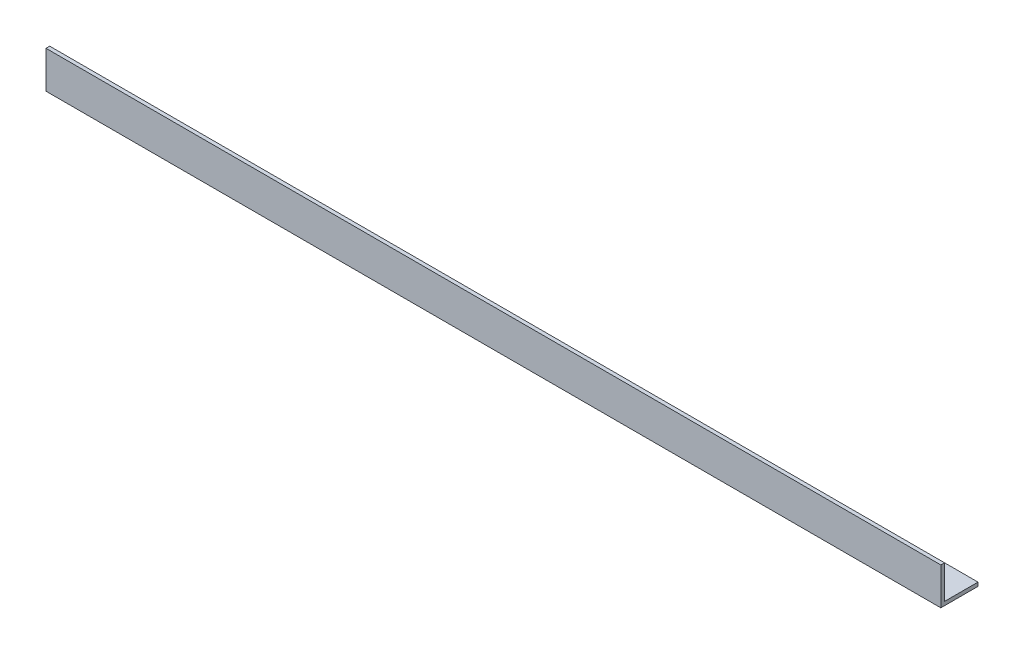
ISO-10303-21;
HEADER;
FILE_DESCRIPTION(('STEP AP214'),'2;1');
FILE_NAME('part.step','',(''),(''),'','','');
FILE_SCHEMA(('AUTOMOTIVE_DESIGN { 1 0 10303 214 1 1 1 1 }'));
ENDSEC;
DATA;
#1=APPLICATION_CONTEXT('core data for automotive mechanical design processes');
#2=APPLICATION_PROTOCOL_DEFINITION('international standard','automotive_design',2000,#1);
#3=PRODUCT_CONTEXT('',#1,'mechanical');
#4=PRODUCT('Part','Part','',(#3));
#5=PRODUCT_RELATED_PRODUCT_CATEGORY('part','',(#4));
#6=PRODUCT_DEFINITION_FORMATION('','',#4);
#7=PRODUCT_DEFINITION_CONTEXT('part definition',#1,'design');
#8=PRODUCT_DEFINITION('design','',#6,#7);
#9=PRODUCT_DEFINITION_SHAPE('','',#8);
#10=(LENGTH_UNIT() NAMED_UNIT(*) SI_UNIT(.MILLI.,.METRE.));
#11=(NAMED_UNIT(*) PLANE_ANGLE_UNIT() SI_UNIT($,.RADIAN.));
#12=(NAMED_UNIT(*) SI_UNIT($,.STERADIAN.) SOLID_ANGLE_UNIT());
#13=UNCERTAINTY_MEASURE_WITH_UNIT(LENGTH_MEASURE(1.E-05),#10,'distance_accuracy_value','');
#14=(GEOMETRIC_REPRESENTATION_CONTEXT(3) GLOBAL_UNCERTAINTY_ASSIGNED_CONTEXT((#13)) GLOBAL_UNIT_ASSIGNED_CONTEXT((#10,
#11,#12)) REPRESENTATION_CONTEXT('',''));
#15=CARTESIAN_POINT('',(0.,0.,0.));
#16=DIRECTION('',(0.,0.,1.));
#17=DIRECTION('',(1.,0.,0.));
#18=AXIS2_PLACEMENT_3D('',#15,#16,#17);
#19=CARTESIAN_POINT('',(361.,0.,-15.));
#20=DIRECTION('',(0.,1.,0.));
#21=DIRECTION('',(0.,0.,1.));
#22=AXIS2_PLACEMENT_3D('',#19,#20,#21);
#23=PLANE('',#22);
#24=DIRECTION('',(0.,0.,-1.));
#25=VECTOR('',#24,1.);
#26=CARTESIAN_POINT('',(0.,0.,-15.));
#27=LINE('',#26,#25);
#28=CARTESIAN_POINT('',(0.,0.,0.));
#29=VERTEX_POINT('',#28);
#30=CARTESIAN_POINT('',(0.,0.,-15.));
#31=VERTEX_POINT('',#30);
#32=EDGE_CURVE('E119',#29,#31,#27,.T.);
#33=ORIENTED_EDGE('',*,*,#32,.T.);
#34=DIRECTION('',(-1.,0.,0.));
#35=VECTOR('',#34,1.);
#36=CARTESIAN_POINT('',(361.,0.,-15.));
#37=LINE('',#36,#35);
#38=CARTESIAN_POINT('',(361.,0.,-15.));
#39=VERTEX_POINT('',#38);
#40=EDGE_CURVE('E11',#39,#31,#37,.T.);
#41=ORIENTED_EDGE('',*,*,#40,.F.);
#42=DIRECTION('',(0.,0.,-1.));
#43=VECTOR('',#42,1.);
#44=CARTESIAN_POINT('',(361.,0.,-15.));
#45=LINE('',#44,#43);
#46=CARTESIAN_POINT('',(361.,0.,0.));
#47=VERTEX_POINT('',#46);
#48=EDGE_CURVE('E129',#47,#39,#45,.T.);
#49=ORIENTED_EDGE('',*,*,#48,.F.);
#50=DIRECTION('',(-1.,0.,0.));
#51=VECTOR('',#50,1.);
#52=CARTESIAN_POINT('',(361.,0.,0.));
#53=LINE('',#52,#51);
#54=EDGE_CURVE('E115',#47,#29,#53,.T.);
#55=ORIENTED_EDGE('',*,*,#54,.T.);
#56=EDGE_LOOP('',(#33,#41,#49,#55));
#57=FACE_BOUND('',#56,.T.);
#58=ADVANCED_FACE('F35',(#57),#23,.F.);
#59=CARTESIAN_POINT('',(361.,1.49999999999998,-15.));
#60=DIRECTION('',(0.,0.,1.));
#61=DIRECTION('',(1.,0.,0.));
#62=AXIS2_PLACEMENT_3D('',#59,#60,#61);
#63=PLANE('',#62);
#64=DIRECTION('',(0.,1.,0.));
#65=VECTOR('',#64,1.);
#66=CARTESIAN_POINT('',(0.,1.49999999999998,-15.));
#67=LINE('',#66,#65);
#68=CARTESIAN_POINT('',(0.,1.49999999999998,-15.));
#69=VERTEX_POINT('',#68);
#70=EDGE_CURVE('E122',#31,#69,#67,.T.);
#71=ORIENTED_EDGE('',*,*,#70,.T.);
#72=DIRECTION('',(-1.,0.,0.));
#73=VECTOR('',#72,1.);
#74=CARTESIAN_POINT('',(361.,1.49999999999998,-15.));
#75=LINE('',#74,#73);
#76=CARTESIAN_POINT('',(361.,1.49999999999998,-15.));
#77=VERTEX_POINT('',#76);
#78=EDGE_CURVE('E43',#77,#69,#75,.T.);
#79=ORIENTED_EDGE('',*,*,#78,.F.);
#80=DIRECTION('',(0.,1.,0.));
#81=VECTOR('',#80,1.);
#82=CARTESIAN_POINT('',(361.,1.49999999999998,-15.));
#83=LINE('',#82,#81);
#84=EDGE_CURVE('E88',#39,#77,#83,.T.);
#85=ORIENTED_EDGE('',*,*,#84,.F.);
#86=ORIENTED_EDGE('',*,*,#40,.T.);
#87=EDGE_LOOP('',(#71,#79,#85,#86));
#88=FACE_BOUND('',#87,.T.);
#89=ADVANCED_FACE('F153',(#88),#63,.F.);
#90=CARTESIAN_POINT('',(361.,1.5,-1.50000000000002));
#91=DIRECTION('',(0.,-1.,0.));
#92=DIRECTION('',(0.,0.,-1.));
#93=AXIS2_PLACEMENT_3D('',#90,#91,#92);
#94=PLANE('',#93);
#95=DIRECTION('',(0.,0.,1.));
#96=VECTOR('',#95,1.);
#97=CARTESIAN_POINT('',(0.,1.5,-1.50000000000002));
#98=LINE('',#97,#96);
#99=CARTESIAN_POINT('',(0.,1.5,-1.50000000000002));
#100=VERTEX_POINT('',#99);
#101=EDGE_CURVE('E124',#69,#100,#98,.T.);
#102=ORIENTED_EDGE('',*,*,#101,.T.);
#103=DIRECTION('',(-1.,0.,0.));
#104=VECTOR('',#103,1.);
#105=CARTESIAN_POINT('',(361.,1.5,-1.50000000000002));
#106=LINE('',#105,#104);
#107=CARTESIAN_POINT('',(361.,1.5,-1.50000000000002));
#108=VERTEX_POINT('',#107);
#109=EDGE_CURVE('E110',#108,#100,#106,.T.);
#110=ORIENTED_EDGE('',*,*,#109,.F.);
#111=DIRECTION('',(0.,0.,1.));
#112=VECTOR('',#111,1.);
#113=CARTESIAN_POINT('',(361.,1.5,-1.50000000000002));
#114=LINE('',#113,#112);
#115=EDGE_CURVE('E101',#77,#108,#114,.T.);
#116=ORIENTED_EDGE('',*,*,#115,.F.);
#117=ORIENTED_EDGE('',*,*,#78,.T.);
#118=EDGE_LOOP('',(#102,#110,#116,#117));
#119=FACE_BOUND('',#118,.T.);
#120=ADVANCED_FACE('F135',(#119),#94,.F.);
#121=CARTESIAN_POINT('',(361.,15.,-1.5));
#122=DIRECTION('',(0.,0.,1.));
#123=DIRECTION('',(0.,-1.,0.));
#124=AXIS2_PLACEMENT_3D('',#121,#122,#123);
#125=PLANE('',#124);
#126=DIRECTION('',(0.,1.,0.));
#127=VECTOR('',#126,1.);
#128=CARTESIAN_POINT('',(0.,15.,-1.5));
#129=LINE('',#128,#127);
#130=CARTESIAN_POINT('',(0.,15.,-1.5));
#131=VERTEX_POINT('',#130);
#132=EDGE_CURVE('E109',#100,#131,#129,.T.);
#133=ORIENTED_EDGE('',*,*,#132,.T.);
#134=DIRECTION('',(-1.,0.,0.));
#135=VECTOR('',#134,1.);
#136=CARTESIAN_POINT('',(361.,15.,-1.5));
#137=LINE('',#136,#135);
#138=CARTESIAN_POINT('',(361.,15.,-1.5));
#139=VERTEX_POINT('',#138);
#140=EDGE_CURVE('E106',#139,#131,#137,.T.);
#141=ORIENTED_EDGE('',*,*,#140,.F.);
#142=DIRECTION('',(0.,1.,0.));
#143=VECTOR('',#142,1.);
#144=CARTESIAN_POINT('',(361.,15.,-1.5));
#145=LINE('',#144,#143);
#146=EDGE_CURVE('E95',#108,#139,#145,.T.);
#147=ORIENTED_EDGE('',*,*,#146,.F.);
#148=ORIENTED_EDGE('',*,*,#109,.T.);
#149=EDGE_LOOP('',(#133,#141,#147,#148));
#150=FACE_BOUND('',#149,.T.);
#151=ADVANCED_FACE('F107',(#150),#125,.F.);
#152=CARTESIAN_POINT('',(361.,15.,0.));
#153=DIRECTION('',(0.,-1.,0.));
#154=DIRECTION('',(0.,0.,-1.));
#155=AXIS2_PLACEMENT_3D('',#152,#153,#154);
#156=PLANE('',#155);
#157=DIRECTION('',(0.,0.,1.));
#158=VECTOR('',#157,1.);
#159=CARTESIAN_POINT('',(0.,15.,0.));
#160=LINE('',#159,#158);
#161=CARTESIAN_POINT('',(0.,15.,0.));
#162=VERTEX_POINT('',#161);
#163=EDGE_CURVE('E74',#131,#162,#160,.T.);
#164=ORIENTED_EDGE('',*,*,#163,.T.);
#165=DIRECTION('',(-1.,0.,0.));
#166=VECTOR('',#165,1.);
#167=CARTESIAN_POINT('',(361.,15.,0.));
#168=LINE('',#167,#166);
#169=CARTESIAN_POINT('',(361.,15.,0.));
#170=VERTEX_POINT('',#169);
#171=EDGE_CURVE('E111',#170,#162,#168,.T.);
#172=ORIENTED_EDGE('',*,*,#171,.F.);
#173=DIRECTION('',(0.,0.,1.));
#174=VECTOR('',#173,1.);
#175=CARTESIAN_POINT('',(361.,15.,0.));
#176=LINE('',#175,#174);
#177=EDGE_CURVE('E99',#139,#170,#176,.T.);
#178=ORIENTED_EDGE('',*,*,#177,.F.);
#179=ORIENTED_EDGE('',*,*,#140,.T.);
#180=EDGE_LOOP('',(#164,#172,#178,#179));
#181=FACE_BOUND('',#180,.T.);
#182=ADVANCED_FACE('F113',(#181),#156,.F.);
#183=CARTESIAN_POINT('',(361.,0.,0.));
#184=DIRECTION('',(0.,0.,-1.));
#185=DIRECTION('',(-1.,0.,0.));
#186=AXIS2_PLACEMENT_3D('',#183,#184,#185);
#187=PLANE('',#186);
#188=DIRECTION('',(0.,-1.,0.));
#189=VECTOR('',#188,1.);
#190=CARTESIAN_POINT('',(0.,0.,0.));
#191=LINE('',#190,#189);
#192=EDGE_CURVE('E80',#162,#29,#191,.T.);
#193=ORIENTED_EDGE('',*,*,#192,.T.);
#194=ORIENTED_EDGE('',*,*,#54,.F.);
#195=DIRECTION('',(0.,-1.,0.));
#196=VECTOR('',#195,1.);
#197=CARTESIAN_POINT('',(361.,0.,0.));
#198=LINE('',#197,#196);
#199=EDGE_CURVE('E51',#170,#47,#198,.T.);
#200=ORIENTED_EDGE('',*,*,#199,.F.);
#201=ORIENTED_EDGE('',*,*,#171,.T.);
#202=EDGE_LOOP('',(#193,#194,#200,#201));
#203=FACE_BOUND('',#202,.T.);
#204=ADVANCED_FACE('F142',(#203),#187,.F.);
#205=CARTESIAN_POINT('',(361.,0.,0.));
#206=DIRECTION('',(-1.,0.,0.));
#207=DIRECTION('',(0.,0.,1.));
#208=AXIS2_PLACEMENT_3D('',#205,#206,#207);
#209=PLANE('',#208);
#210=ORIENTED_EDGE('',*,*,#48,.T.);
#211=ORIENTED_EDGE('',*,*,#84,.T.);
#212=ORIENTED_EDGE('',*,*,#115,.T.);
#213=ORIENTED_EDGE('',*,*,#146,.T.);
#214=ORIENTED_EDGE('',*,*,#177,.T.);
#215=ORIENTED_EDGE('',*,*,#199,.T.);
#216=EDGE_LOOP('',(#210,#211,#212,#213,#214,#215));
#217=FACE_BOUND('',#216,.T.);
#218=ADVANCED_FACE('F97',(#217),#209,.F.);
#219=CARTESIAN_POINT('',(0.,0.,0.));
#220=DIRECTION('',(-1.,0.,0.));
#221=DIRECTION('',(0.,0.,1.));
#222=AXIS2_PLACEMENT_3D('',#219,#220,#221);
#223=PLANE('',#222);
#224=ORIENTED_EDGE('',*,*,#32,.F.);
#225=ORIENTED_EDGE('',*,*,#192,.F.);
#226=ORIENTED_EDGE('',*,*,#163,.F.);
#227=ORIENTED_EDGE('',*,*,#132,.F.);
#228=ORIENTED_EDGE('',*,*,#101,.F.);
#229=ORIENTED_EDGE('',*,*,#70,.F.);
#230=EDGE_LOOP('',(#224,#225,#226,#227,#228,#229));
#231=FACE_BOUND('',#230,.T.);
#232=ADVANCED_FACE('F138',(#231),#223,.T.);
#233=CLOSED_SHELL('',(#58,#89,#120,#151,#182,#204,#218,#232));
#234=MANIFOLD_SOLID_BREP('B2',#233);
#235=ADVANCED_BREP_SHAPE_REPRESENTATION('',(#18,#234),#14);
#236=SHAPE_DEFINITION_REPRESENTATION(#9,#235);
ENDSEC;
END-ISO-10303-21;
